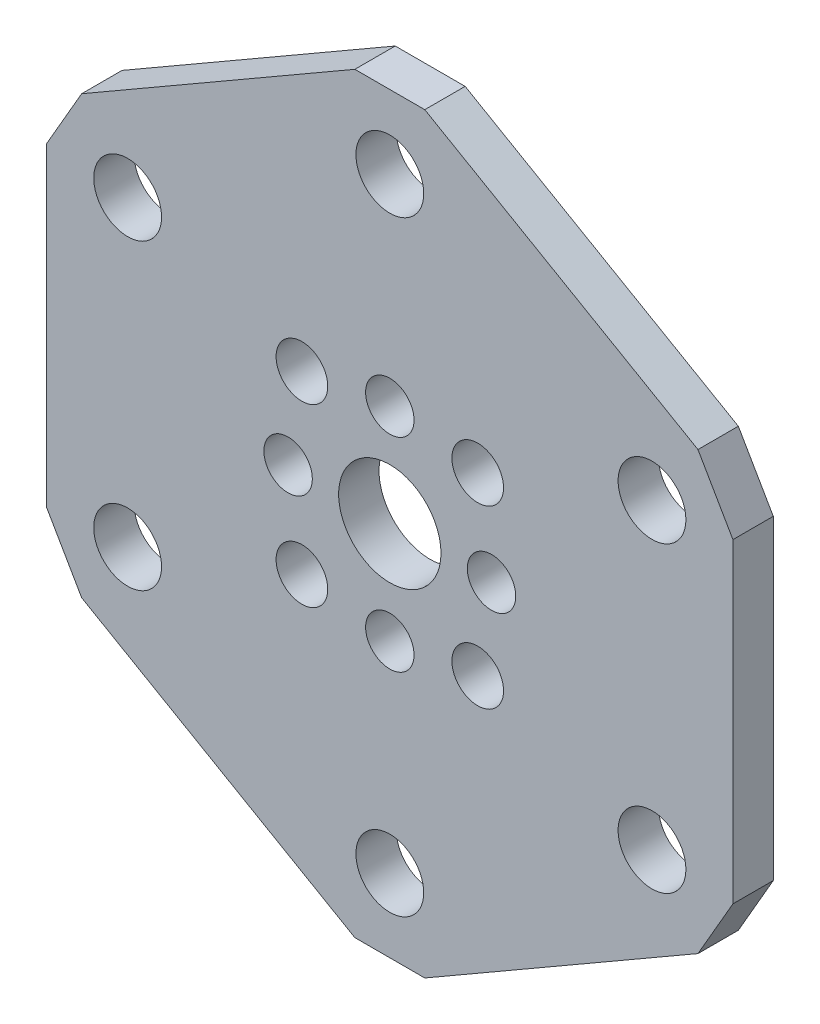
ISO-10303-21;
HEADER;
FILE_DESCRIPTION(('STEP AP214'),'2;1');
FILE_NAME('part.step','',(''),(''),'','','');
FILE_SCHEMA(('AUTOMOTIVE_DESIGN { 1 0 10303 214 1 1 1 1 }'));
ENDSEC;
DATA;
#1=APPLICATION_CONTEXT('core data for automotive mechanical design processes');
#2=APPLICATION_PROTOCOL_DEFINITION('international standard','automotive_design',2000,#1);
#3=PRODUCT_CONTEXT('',#1,'mechanical');
#4=PRODUCT('Part','Part','',(#3));
#5=PRODUCT_RELATED_PRODUCT_CATEGORY('part','',(#4));
#6=PRODUCT_DEFINITION_FORMATION('','',#4);
#7=PRODUCT_DEFINITION_CONTEXT('part definition',#1,'design');
#8=PRODUCT_DEFINITION('design','',#6,#7);
#9=PRODUCT_DEFINITION_SHAPE('','',#8);
#10=(LENGTH_UNIT() NAMED_UNIT(*) SI_UNIT(.MILLI.,.METRE.));
#11=(NAMED_UNIT(*) PLANE_ANGLE_UNIT() SI_UNIT($,.RADIAN.));
#12=(NAMED_UNIT(*) SI_UNIT($,.STERADIAN.) SOLID_ANGLE_UNIT());
#13=UNCERTAINTY_MEASURE_WITH_UNIT(LENGTH_MEASURE(1.E-05),#10,'distance_accuracy_value','');
#14=(GEOMETRIC_REPRESENTATION_CONTEXT(3) GLOBAL_UNCERTAINTY_ASSIGNED_CONTEXT((#13)) GLOBAL_UNIT_ASSIGNED_CONTEXT((#10,
#11,#12)) REPRESENTATION_CONTEXT('',''));
#15=CARTESIAN_POINT('',(0.,0.,0.));
#16=DIRECTION('',(0.,0.,1.));
#17=DIRECTION('',(1.,0.,0.));
#18=AXIS2_PLACEMENT_3D('',#15,#16,#17);
#19=CARTESIAN_POINT('',(-24.2378693429844,17.168740389755,3.175));
#20=DIRECTION('',(-0.5,0.866025403784439,0.));
#21=DIRECTION('',(-0.866025403784439,-0.5,0.));
#22=AXIS2_PLACEMENT_3D('',#19,#20,#21);
#23=PLANE('',#22);
#24=DIRECTION('',(0.866025403784439,0.5,0.));
#25=VECTOR('',#24,1.);
#26=CARTESIAN_POINT('',(-24.2378693429844,17.168740389755,0.));
#27=LINE('',#26,#25);
#28=CARTESIAN_POINT('',(-24.2378693429844,17.168740389755,0.));
#29=VERTEX_POINT('',#28);
#30=CARTESIAN_POINT('',(-2.74963065701559,29.5749807795101,0.));
#31=VERTEX_POINT('',#30);
#32=EDGE_CURVE('E153',#29,#31,#27,.T.);
#33=ORIENTED_EDGE('',*,*,#32,.F.);
#34=DIRECTION('',(0.,0.,-1.));
#35=VECTOR('',#34,1.);
#36=CARTESIAN_POINT('',(-24.2378693429844,17.168740389755,3.175));
#37=LINE('',#36,#35);
#38=CARTESIAN_POINT('',(-24.2378693429844,17.168740389755,3.175));
#39=VERTEX_POINT('',#38);
#40=EDGE_CURVE('E11',#39,#29,#37,.T.);
#41=ORIENTED_EDGE('',*,*,#40,.F.);
#42=DIRECTION('',(0.866025403784439,0.5,0.));
#43=VECTOR('',#42,1.);
#44=CARTESIAN_POINT('',(-24.2378693429844,17.168740389755,3.175));
#45=LINE('',#44,#43);
#46=CARTESIAN_POINT('',(-2.74963065701559,29.5749807795101,3.175));
#47=VERTEX_POINT('',#46);
#48=EDGE_CURVE('E186',#39,#47,#45,.T.);
#49=ORIENTED_EDGE('',*,*,#48,.T.);
#50=DIRECTION('',(0.,0.,-1.));
#51=VECTOR('',#50,1.);
#52=CARTESIAN_POINT('',(-2.74963065701559,29.5749807795101,3.175));
#53=LINE('',#52,#51);
#54=EDGE_CURVE('E35',#47,#31,#53,.T.);
#55=ORIENTED_EDGE('',*,*,#54,.T.);
#56=EDGE_LOOP('',(#33,#41,#49,#55));
#57=FACE_BOUND('',#56,.T.);
#58=ADVANCED_FACE('F32',(#57),#23,.T.);
#59=CARTESIAN_POINT('',(-26.9875,12.406240389755,3.175));
#60=DIRECTION('',(-0.866025403784438,0.5,0.));
#61=DIRECTION('',(-0.5,-0.866025403784439,0.));
#62=AXIS2_PLACEMENT_3D('',#59,#60,#61);
#63=PLANE('',#62);
#64=DIRECTION('',(0.5,0.866025403784439,0.));
#65=VECTOR('',#64,1.);
#66=CARTESIAN_POINT('',(-26.9875,12.406240389755,0.));
#67=LINE('',#66,#65);
#68=CARTESIAN_POINT('',(-26.9875,12.406240389755,0.));
#69=VERTEX_POINT('',#68);
#70=EDGE_CURVE('E184',#69,#29,#67,.T.);
#71=ORIENTED_EDGE('',*,*,#70,.F.);
#72=DIRECTION('',(0.,0.,-1.));
#73=VECTOR('',#72,1.);
#74=CARTESIAN_POINT('',(-26.9875,12.406240389755,3.175));
#75=LINE('',#74,#73);
#76=CARTESIAN_POINT('',(-26.9875,12.406240389755,3.175));
#77=VERTEX_POINT('',#76);
#78=EDGE_CURVE('E41',#77,#69,#75,.T.);
#79=ORIENTED_EDGE('',*,*,#78,.F.);
#80=DIRECTION('',(0.5,0.866025403784439,0.));
#81=VECTOR('',#80,1.);
#82=CARTESIAN_POINT('',(-26.9875,12.406240389755,3.175));
#83=LINE('',#82,#81);
#84=EDGE_CURVE('E143',#77,#39,#83,.T.);
#85=ORIENTED_EDGE('',*,*,#84,.T.);
#86=ORIENTED_EDGE('',*,*,#40,.T.);
#87=EDGE_LOOP('',(#71,#79,#85,#86));
#88=FACE_BOUND('',#87,.T.);
#89=ADVANCED_FACE('F206',(#88),#63,.T.);
#90=CARTESIAN_POINT('',(-26.9875,-12.406240389755,3.175));
#91=DIRECTION('',(-1.,0.,0.));
#92=DIRECTION('',(0.,-1.,0.));
#93=AXIS2_PLACEMENT_3D('',#90,#91,#92);
#94=PLANE('',#93);
#95=DIRECTION('',(0.,1.,0.));
#96=VECTOR('',#95,1.);
#97=CARTESIAN_POINT('',(-26.9875,-12.406240389755,0.));
#98=LINE('',#97,#96);
#99=CARTESIAN_POINT('',(-26.9875,-12.406240389755,0.));
#100=VERTEX_POINT('',#99);
#101=EDGE_CURVE('E130',#100,#69,#98,.T.);
#102=ORIENTED_EDGE('',*,*,#101,.F.);
#103=DIRECTION('',(0.,0.,-1.));
#104=VECTOR('',#103,1.);
#105=CARTESIAN_POINT('',(-26.9875,-12.406240389755,3.175));
#106=LINE('',#105,#104);
#107=CARTESIAN_POINT('',(-26.9875,-12.406240389755,3.175));
#108=VERTEX_POINT('',#107);
#109=EDGE_CURVE('E125',#108,#100,#106,.T.);
#110=ORIENTED_EDGE('',*,*,#109,.F.);
#111=DIRECTION('',(0.,1.,0.));
#112=VECTOR('',#111,1.);
#113=CARTESIAN_POINT('',(-26.9875,-12.406240389755,3.175));
#114=LINE('',#113,#112);
#115=EDGE_CURVE('E128',#108,#77,#114,.T.);
#116=ORIENTED_EDGE('',*,*,#115,.T.);
#117=ORIENTED_EDGE('',*,*,#78,.T.);
#118=EDGE_LOOP('',(#102,#110,#116,#117));
#119=FACE_BOUND('',#118,.T.);
#120=ADVANCED_FACE('F127',(#119),#94,.T.);
#121=CARTESIAN_POINT('',(-24.2378693429844,-17.168740389755,3.175));
#122=DIRECTION('',(-0.866025403784439,-0.5,0.));
#123=DIRECTION('',(0.5,-0.866025403784439,0.));
#124=AXIS2_PLACEMENT_3D('',#121,#122,#123);
#125=PLANE('',#124);
#126=DIRECTION('',(-0.5,0.866025403784439,0.));
#127=VECTOR('',#126,1.);
#128=CARTESIAN_POINT('',(-24.2378693429844,-17.168740389755,0.));
#129=LINE('',#128,#127);
#130=CARTESIAN_POINT('',(-24.2378693429844,-17.168740389755,0.));
#131=VERTEX_POINT('',#130);
#132=EDGE_CURVE('E181',#131,#100,#129,.T.);
#133=ORIENTED_EDGE('',*,*,#132,.F.);
#134=DIRECTION('',(0.,0.,-1.));
#135=VECTOR('',#134,1.);
#136=CARTESIAN_POINT('',(-24.2378693429844,-17.168740389755,3.175));
#137=LINE('',#136,#135);
#138=CARTESIAN_POINT('',(-24.2378693429844,-17.168740389755,3.175));
#139=VERTEX_POINT('',#138);
#140=EDGE_CURVE('E135',#139,#131,#137,.T.);
#141=ORIENTED_EDGE('',*,*,#140,.F.);
#142=DIRECTION('',(-0.5,0.866025403784439,0.));
#143=VECTOR('',#142,1.);
#144=CARTESIAN_POINT('',(-24.2378693429844,-17.168740389755,3.175));
#145=LINE('',#144,#143);
#146=EDGE_CURVE('E141',#139,#108,#145,.T.);
#147=ORIENTED_EDGE('',*,*,#146,.T.);
#148=ORIENTED_EDGE('',*,*,#109,.T.);
#149=EDGE_LOOP('',(#133,#141,#147,#148));
#150=FACE_BOUND('',#149,.T.);
#151=ADVANCED_FACE('F145',(#150),#125,.T.);
#152=CARTESIAN_POINT('',(-2.7496306570156,-29.57498077951,3.175));
#153=DIRECTION('',(-0.5,-0.866025403784439,0.));
#154=DIRECTION('',(0.866025403784439,-0.5,0.));
#155=AXIS2_PLACEMENT_3D('',#152,#153,#154);
#156=PLANE('',#155);
#157=DIRECTION('',(-0.866025403784438,0.5,0.));
#158=VECTOR('',#157,1.);
#159=CARTESIAN_POINT('',(-2.7496306570156,-29.57498077951,0.));
#160=LINE('',#159,#158);
#161=CARTESIAN_POINT('',(-2.7496306570156,-29.57498077951,0.));
#162=VERTEX_POINT('',#161);
#163=EDGE_CURVE('E178',#162,#131,#160,.T.);
#164=ORIENTED_EDGE('',*,*,#163,.F.);
#165=DIRECTION('',(0.,0.,-1.));
#166=VECTOR('',#165,1.);
#167=CARTESIAN_POINT('',(-2.7496306570156,-29.57498077951,3.175));
#168=LINE('',#167,#166);
#169=CARTESIAN_POINT('',(-2.7496306570156,-29.57498077951,3.175));
#170=VERTEX_POINT('',#169);
#171=EDGE_CURVE('E190',#170,#162,#168,.T.);
#172=ORIENTED_EDGE('',*,*,#171,.F.);
#173=DIRECTION('',(-0.866025403784438,0.5,0.));
#174=VECTOR('',#173,1.);
#175=CARTESIAN_POINT('',(-2.7496306570156,-29.57498077951,3.175));
#176=LINE('',#175,#174);
#177=EDGE_CURVE('E146',#170,#139,#176,.T.);
#178=ORIENTED_EDGE('',*,*,#177,.T.);
#179=ORIENTED_EDGE('',*,*,#140,.T.);
#180=EDGE_LOOP('',(#164,#172,#178,#179));
#181=FACE_BOUND('',#180,.T.);
#182=ADVANCED_FACE('F219',(#181),#156,.T.);
#183=CARTESIAN_POINT('',(2.74963065701558,-29.57498077951,3.175));
#184=DIRECTION('',(0.,-1.,0.));
#185=DIRECTION('',(0.,0.,-1.));
#186=AXIS2_PLACEMENT_3D('',#183,#184,#185);
#187=PLANE('',#186);
#188=DIRECTION('',(-1.,0.,0.));
#189=VECTOR('',#188,1.);
#190=CARTESIAN_POINT('',(2.74963065701558,-29.57498077951,0.));
#191=LINE('',#190,#189);
#192=CARTESIAN_POINT('',(2.74963065701558,-29.57498077951,0.));
#193=VERTEX_POINT('',#192);
#194=EDGE_CURVE('E175',#193,#162,#191,.T.);
#195=ORIENTED_EDGE('',*,*,#194,.F.);
#196=DIRECTION('',(0.,0.,-1.));
#197=VECTOR('',#196,1.);
#198=CARTESIAN_POINT('',(2.74963065701558,-29.57498077951,3.175));
#199=LINE('',#198,#197);
#200=CARTESIAN_POINT('',(2.74963065701558,-29.57498077951,3.175));
#201=VERTEX_POINT('',#200);
#202=EDGE_CURVE('E192',#201,#193,#199,.T.);
#203=ORIENTED_EDGE('',*,*,#202,.F.);
#204=DIRECTION('',(-1.,0.,0.));
#205=VECTOR('',#204,1.);
#206=CARTESIAN_POINT('',(2.74963065701558,-29.57498077951,3.175));
#207=LINE('',#206,#205);
#208=EDGE_CURVE('E148',#201,#170,#207,.T.);
#209=ORIENTED_EDGE('',*,*,#208,.T.);
#210=ORIENTED_EDGE('',*,*,#171,.T.);
#211=EDGE_LOOP('',(#195,#203,#209,#210));
#212=FACE_BOUND('',#211,.T.);
#213=ADVANCED_FACE('F222',(#212),#187,.T.);
#214=CARTESIAN_POINT('',(24.2378693429844,-17.168740389755,3.175));
#215=DIRECTION('',(0.5,-0.866025403784439,0.));
#216=DIRECTION('',(0.866025403784439,0.5,0.));
#217=AXIS2_PLACEMENT_3D('',#214,#215,#216);
#218=PLANE('',#217);
#219=DIRECTION('',(-0.866025403784439,-0.5,0.));
#220=VECTOR('',#219,1.);
#221=CARTESIAN_POINT('',(24.2378693429844,-17.168740389755,0.));
#222=LINE('',#221,#220);
#223=CARTESIAN_POINT('',(24.2378693429844,-17.168740389755,0.));
#224=VERTEX_POINT('',#223);
#225=EDGE_CURVE('E172',#224,#193,#222,.T.);
#226=ORIENTED_EDGE('',*,*,#225,.F.);
#227=DIRECTION('',(0.,0.,-1.));
#228=VECTOR('',#227,1.);
#229=CARTESIAN_POINT('',(24.2378693429844,-17.168740389755,3.175));
#230=LINE('',#229,#228);
#231=CARTESIAN_POINT('',(24.2378693429844,-17.168740389755,3.175));
#232=VERTEX_POINT('',#231);
#233=EDGE_CURVE('E194',#232,#224,#230,.T.);
#234=ORIENTED_EDGE('',*,*,#233,.F.);
#235=DIRECTION('',(-0.866025403784439,-0.5,0.));
#236=VECTOR('',#235,1.);
#237=CARTESIAN_POINT('',(24.2378693429844,-17.168740389755,3.175));
#238=LINE('',#237,#236);
#239=EDGE_CURVE('E426',#232,#201,#238,.T.);
#240=ORIENTED_EDGE('',*,*,#239,.T.);
#241=ORIENTED_EDGE('',*,*,#202,.T.);
#242=EDGE_LOOP('',(#226,#234,#240,#241));
#243=FACE_BOUND('',#242,.T.);
#244=ADVANCED_FACE('F226',(#243),#218,.T.);
#245=CARTESIAN_POINT('',(26.9875,-12.406240389755,3.175));
#246=DIRECTION('',(0.866025403784438,-0.5,0.));
#247=DIRECTION('',(0.5,0.866025403784439,0.));
#248=AXIS2_PLACEMENT_3D('',#245,#246,#247);
#249=PLANE('',#248);
#250=DIRECTION('',(-0.5,-0.866025403784438,0.));
#251=VECTOR('',#250,1.);
#252=CARTESIAN_POINT('',(26.9875,-12.406240389755,0.));
#253=LINE('',#252,#251);
#254=CARTESIAN_POINT('',(26.9875,-12.406240389755,0.));
#255=VERTEX_POINT('',#254);
#256=EDGE_CURVE('E169',#255,#224,#253,.T.);
#257=ORIENTED_EDGE('',*,*,#256,.F.);
#258=DIRECTION('',(0.,0.,-1.));
#259=VECTOR('',#258,1.);
#260=CARTESIAN_POINT('',(26.9875,-12.406240389755,3.175));
#261=LINE('',#260,#259);
#262=CARTESIAN_POINT('',(26.9875,-12.406240389755,3.175));
#263=VERTEX_POINT('',#262);
#264=EDGE_CURVE('E196',#263,#255,#261,.T.);
#265=ORIENTED_EDGE('',*,*,#264,.F.);
#266=DIRECTION('',(-0.5,-0.866025403784438,0.));
#267=VECTOR('',#266,1.);
#268=CARTESIAN_POINT('',(26.9875,-12.406240389755,3.175));
#269=LINE('',#268,#267);
#270=EDGE_CURVE('E423',#263,#232,#269,.T.);
#271=ORIENTED_EDGE('',*,*,#270,.T.);
#272=ORIENTED_EDGE('',*,*,#233,.T.);
#273=EDGE_LOOP('',(#257,#265,#271,#272));
#274=FACE_BOUND('',#273,.T.);
#275=ADVANCED_FACE('F230',(#274),#249,.T.);
#276=CARTESIAN_POINT('',(26.9875,12.406240389755,3.175));
#277=DIRECTION('',(1.,0.,0.));
#278=DIRECTION('',(0.,1.,0.));
#279=AXIS2_PLACEMENT_3D('',#276,#277,#278);
#280=PLANE('',#279);
#281=DIRECTION('',(0.,-1.,0.));
#282=VECTOR('',#281,1.);
#283=CARTESIAN_POINT('',(26.9875,12.406240389755,0.));
#284=LINE('',#283,#282);
#285=CARTESIAN_POINT('',(26.9875,12.406240389755,0.));
#286=VERTEX_POINT('',#285);
#287=EDGE_CURVE('E166',#286,#255,#284,.T.);
#288=ORIENTED_EDGE('',*,*,#287,.F.);
#289=DIRECTION('',(0.,0.,-1.));
#290=VECTOR('',#289,1.);
#291=CARTESIAN_POINT('',(26.9875,12.406240389755,3.175));
#292=LINE('',#291,#290);
#293=CARTESIAN_POINT('',(26.9875,12.406240389755,3.175));
#294=VERTEX_POINT('',#293);
#295=EDGE_CURVE('E198',#294,#286,#292,.T.);
#296=ORIENTED_EDGE('',*,*,#295,.F.);
#297=DIRECTION('',(0.,-1.,0.));
#298=VECTOR('',#297,1.);
#299=CARTESIAN_POINT('',(26.9875,12.406240389755,3.175));
#300=LINE('',#299,#298);
#301=EDGE_CURVE('E420',#294,#263,#300,.T.);
#302=ORIENTED_EDGE('',*,*,#301,.T.);
#303=ORIENTED_EDGE('',*,*,#264,.T.);
#304=EDGE_LOOP('',(#288,#296,#302,#303));
#305=FACE_BOUND('',#304,.T.);
#306=ADVANCED_FACE('F234',(#305),#280,.T.);
#307=CARTESIAN_POINT('',(24.2378693429844,17.168740389755,3.175));
#308=DIRECTION('',(0.866025403784439,0.5,0.));
#309=DIRECTION('',(-0.5,0.866025403784439,0.));
#310=AXIS2_PLACEMENT_3D('',#307,#308,#309);
#311=PLANE('',#310);
#312=DIRECTION('',(0.5,-0.866025403784439,0.));
#313=VECTOR('',#312,1.);
#314=CARTESIAN_POINT('',(24.2378693429844,17.168740389755,0.));
#315=LINE('',#314,#313);
#316=CARTESIAN_POINT('',(24.2378693429844,17.168740389755,0.));
#317=VERTEX_POINT('',#316);
#318=EDGE_CURVE('E163',#317,#286,#315,.T.);
#319=ORIENTED_EDGE('',*,*,#318,.F.);
#320=DIRECTION('',(0.,0.,-1.));
#321=VECTOR('',#320,1.);
#322=CARTESIAN_POINT('',(24.2378693429844,17.168740389755,3.175));
#323=LINE('',#322,#321);
#324=CARTESIAN_POINT('',(24.2378693429844,17.168740389755,3.175));
#325=VERTEX_POINT('',#324);
#326=EDGE_CURVE('E200',#325,#317,#323,.T.);
#327=ORIENTED_EDGE('',*,*,#326,.F.);
#328=DIRECTION('',(0.5,-0.866025403784439,0.));
#329=VECTOR('',#328,1.);
#330=CARTESIAN_POINT('',(24.2378693429844,17.168740389755,3.175));
#331=LINE('',#330,#329);
#332=EDGE_CURVE('E417',#325,#294,#331,.T.);
#333=ORIENTED_EDGE('',*,*,#332,.T.);
#334=ORIENTED_EDGE('',*,*,#295,.T.);
#335=EDGE_LOOP('',(#319,#327,#333,#334));
#336=FACE_BOUND('',#335,.T.);
#337=ADVANCED_FACE('F238',(#336),#311,.T.);
#338=CARTESIAN_POINT('',(2.74963065701559,29.5749807795101,3.175));
#339=DIRECTION('',(0.5,0.866025403784438,0.));
#340=DIRECTION('',(-0.866025403784439,0.5,0.));
#341=AXIS2_PLACEMENT_3D('',#338,#339,#340);
#342=PLANE('',#341);
#343=DIRECTION('',(0.866025403784438,-0.5,0.));
#344=VECTOR('',#343,1.);
#345=CARTESIAN_POINT('',(2.74963065701559,29.5749807795101,0.));
#346=LINE('',#345,#344);
#347=CARTESIAN_POINT('',(2.74963065701559,29.5749807795101,0.));
#348=VERTEX_POINT('',#347);
#349=EDGE_CURVE('E160',#348,#317,#346,.T.);
#350=ORIENTED_EDGE('',*,*,#349,.F.);
#351=DIRECTION('',(0.,0.,-1.));
#352=VECTOR('',#351,1.);
#353=CARTESIAN_POINT('',(2.74963065701559,29.5749807795101,3.175));
#354=LINE('',#353,#352);
#355=CARTESIAN_POINT('',(2.74963065701559,29.5749807795101,3.175));
#356=VERTEX_POINT('',#355);
#357=EDGE_CURVE('E201',#356,#348,#354,.T.);
#358=ORIENTED_EDGE('',*,*,#357,.F.);
#359=DIRECTION('',(0.866025403784438,-0.5,0.));
#360=VECTOR('',#359,1.);
#361=CARTESIAN_POINT('',(2.74963065701559,29.5749807795101,3.175));
#362=LINE('',#361,#360);
#363=EDGE_CURVE('E414',#356,#325,#362,.T.);
#364=ORIENTED_EDGE('',*,*,#363,.T.);
#365=ORIENTED_EDGE('',*,*,#326,.T.);
#366=EDGE_LOOP('',(#350,#358,#364,#365));
#367=FACE_BOUND('',#366,.T.);
#368=ADVANCED_FACE('F242',(#367),#342,.T.);
#369=CARTESIAN_POINT('',(-2.74963065701559,29.5749807795101,3.175));
#370=DIRECTION('',(0.,1.,0.));
#371=DIRECTION('',(0.,0.,1.));
#372=AXIS2_PLACEMENT_3D('',#369,#370,#371);
#373=PLANE('',#372);
#374=DIRECTION('',(1.,0.,0.));
#375=VECTOR('',#374,1.);
#376=CARTESIAN_POINT('',(-2.74963065701559,29.5749807795101,0.));
#377=LINE('',#376,#375);
#378=EDGE_CURVE('E156',#31,#348,#377,.T.);
#379=ORIENTED_EDGE('',*,*,#378,.F.);
#380=ORIENTED_EDGE('',*,*,#54,.F.);
#381=DIRECTION('',(1.,0.,0.));
#382=VECTOR('',#381,1.);
#383=CARTESIAN_POINT('',(-2.74963065701559,29.5749807795101,3.175));
#384=LINE('',#383,#382);
#385=EDGE_CURVE('E412',#47,#356,#384,.T.);
#386=ORIENTED_EDGE('',*,*,#385,.T.);
#387=ORIENTED_EDGE('',*,*,#357,.T.);
#388=EDGE_LOOP('',(#379,#380,#386,#387));
#389=FACE_BOUND('',#388,.T.);
#390=ADVANCED_FACE('F203',(#389),#373,.T.);
#391=CARTESIAN_POINT('',(0.,0.,3.175));
#392=DIRECTION('',(0.,0.,-1.));
#393=DIRECTION('',(-1.,0.,0.));
#394=AXIS2_PLACEMENT_3D('',#391,#392,#393);
#395=PLANE('',#394);
#396=CARTESIAN_POINT('',(-6.91479721322323,6.91479721322326,3.175));
#397=DIRECTION('',(0.,0.,-1.));
#398=DIRECTION('',(1.,0.,0.));
#399=AXIS2_PLACEMENT_3D('',#396,#397,#398);
#400=CIRCLE('',#399,2.03200000000004);
#401=CARTESIAN_POINT('',(-4.88279721322319,6.91479721322326,3.175));
#402=VERTEX_POINT('',#401);
#403=EDGE_CURVE('E321',#402,#402,#400,.T.);
#404=ORIENTED_EDGE('',*,*,#403,.T.);
#405=EDGE_LOOP('',(#404));
#406=FACE_BOUND('',#405,.T.);
#407=CARTESIAN_POINT('',(-6.91479721322326,-6.91479721322323,3.175));
#408=DIRECTION('',(0.,0.,-1.));
#409=DIRECTION('',(1.,0.,0.));
#410=AXIS2_PLACEMENT_3D('',#407,#408,#409);
#411=CIRCLE('',#410,2.03200000000003);
#412=CARTESIAN_POINT('',(-4.88279721322323,-6.91479721322323,3.175));
#413=VERTEX_POINT('',#412);
#414=EDGE_CURVE('E329',#413,#413,#411,.T.);
#415=ORIENTED_EDGE('',*,*,#414,.T.);
#416=EDGE_LOOP('',(#415));
#417=FACE_BOUND('',#416,.T.);
#418=CARTESIAN_POINT('',(6.91479721322321,-6.91479721322328,3.175));
#419=DIRECTION('',(0.,0.,-1.));
#420=DIRECTION('',(1.,0.,0.));
#421=AXIS2_PLACEMENT_3D('',#418,#419,#420);
#422=CIRCLE('',#421,2.032);
#423=CARTESIAN_POINT('',(8.94679721322321,-6.91479721322328,3.175));
#424=VERTEX_POINT('',#423);
#425=EDGE_CURVE('E335',#424,#424,#422,.T.);
#426=ORIENTED_EDGE('',*,*,#425,.T.);
#427=EDGE_LOOP('',(#426));
#428=FACE_BOUND('',#427,.T.);
#429=CARTESIAN_POINT('',(6.91479721322326,6.91479721322323,3.175));
#430=DIRECTION('',(0.,0.,-1.));
#431=DIRECTION('',(1.,0.,0.));
#432=AXIS2_PLACEMENT_3D('',#429,#430,#431);
#433=CIRCLE('',#432,2.032);
#434=CARTESIAN_POINT('',(8.94679721322326,6.91479721322323,3.175));
#435=VERTEX_POINT('',#434);
#436=EDGE_CURVE('E341',#435,#435,#433,.T.);
#437=ORIENTED_EDGE('',*,*,#436,.T.);
#438=EDGE_LOOP('',(#437));
#439=FACE_BOUND('',#438,.T.);
#440=CARTESIAN_POINT('',(-20.6222299276169,-11.90625,3.175));
#441=DIRECTION('',(0.,0.,-1.));
#442=DIRECTION('',(1.,0.,0.));
#443=AXIS2_PLACEMENT_3D('',#440,#441,#442);
#444=CIRCLE('',#443,2.66700000000022);
#445=CARTESIAN_POINT('',(-17.9552299276167,-11.90625,3.175));
#446=VERTEX_POINT('',#445);
#447=EDGE_CURVE('E347',#446,#446,#444,.T.);
#448=ORIENTED_EDGE('',*,*,#447,.T.);
#449=EDGE_LOOP('',(#448));
#450=FACE_BOUND('',#449,.T.);
#451=CARTESIAN_POINT('',(20.6222299276169,-11.9062500000001,3.175));
#452=DIRECTION('',(0.,0.,-1.));
#453=DIRECTION('',(1.,0.,0.));
#454=AXIS2_PLACEMENT_3D('',#451,#452,#453);
#455=CIRCLE('',#454,2.667);
#456=CARTESIAN_POINT('',(23.2892299276169,-11.9062500000001,3.175));
#457=VERTEX_POINT('',#456);
#458=EDGE_CURVE('E353',#457,#457,#455,.T.);
#459=ORIENTED_EDGE('',*,*,#458,.T.);
#460=EDGE_LOOP('',(#459));
#461=FACE_BOUND('',#460,.T.);
#462=CARTESIAN_POINT('',(-8.,0.,3.175));
#463=DIRECTION('',(0.,0.,-1.));
#464=DIRECTION('',(1.,0.,0.));
#465=AXIS2_PLACEMENT_3D('',#462,#463,#464);
#466=CIRCLE('',#465,1.90500000000008);
#467=CARTESIAN_POINT('',(-6.09499999999992,0.,3.175));
#468=VERTEX_POINT('',#467);
#469=EDGE_CURVE('E359',#468,#468,#466,.T.);
#470=ORIENTED_EDGE('',*,*,#469,.T.);
#471=EDGE_LOOP('',(#470));
#472=FACE_BOUND('',#471,.T.);
#473=CARTESIAN_POINT('',(8.,0.,3.175));
#474=DIRECTION('',(0.,0.,-1.));
#475=DIRECTION('',(1.,0.,0.));
#476=AXIS2_PLACEMENT_3D('',#473,#474,#475);
#477=CIRCLE('',#476,1.905);
#478=CARTESIAN_POINT('',(9.905,0.,3.175));
#479=VERTEX_POINT('',#478);
#480=EDGE_CURVE('E365',#479,#479,#477,.T.);
#481=ORIENTED_EDGE('',*,*,#480,.T.);
#482=EDGE_LOOP('',(#481));
#483=FACE_BOUND('',#482,.T.);
#484=CARTESIAN_POINT('',(0.,0.,3.175));
#485=DIRECTION('',(0.,0.,-1.));
#486=DIRECTION('',(1.,0.,0.));
#487=AXIS2_PLACEMENT_3D('',#484,#485,#486);
#488=CIRCLE('',#487,4.025);
#489=CARTESIAN_POINT('',(4.025,0.,3.175));
#490=VERTEX_POINT('',#489);
#491=EDGE_CURVE('E371',#490,#490,#488,.T.);
#492=ORIENTED_EDGE('',*,*,#491,.T.);
#493=EDGE_LOOP('',(#492));
#494=FACE_BOUND('',#493,.T.);
#495=CARTESIAN_POINT('',(0.,23.8125,3.175));
#496=DIRECTION('',(0.,0.,-1.));
#497=DIRECTION('',(1.,0.,0.));
#498=AXIS2_PLACEMENT_3D('',#495,#496,#497);
#499=CIRCLE('',#498,2.66699999999999);
#500=CARTESIAN_POINT('',(2.667,23.8125,3.175));
#501=VERTEX_POINT('',#500);
#502=EDGE_CURVE('E377',#501,#501,#499,.T.);
#503=ORIENTED_EDGE('',*,*,#502,.T.);
#504=EDGE_LOOP('',(#503));
#505=FACE_BOUND('',#504,.T.);
#506=CARTESIAN_POINT('',(0.,8.,3.175));
#507=DIRECTION('',(0.,0.,-1.));
#508=DIRECTION('',(1.,0.,0.));
#509=AXIS2_PLACEMENT_3D('',#506,#507,#508);
#510=CIRCLE('',#509,1.905);
#511=CARTESIAN_POINT('',(1.905,8.,3.175));
#512=VERTEX_POINT('',#511);
#513=EDGE_CURVE('E383',#512,#512,#510,.T.);
#514=ORIENTED_EDGE('',*,*,#513,.T.);
#515=EDGE_LOOP('',(#514));
#516=FACE_BOUND('',#515,.T.);
#517=CARTESIAN_POINT('',(0.,-8.,3.175));
#518=DIRECTION('',(0.,0.,-1.));
#519=DIRECTION('',(1.,0.,0.));
#520=AXIS2_PLACEMENT_3D('',#517,#518,#519);
#521=CIRCLE('',#520,1.90500000000005);
#522=CARTESIAN_POINT('',(1.90500000000005,-8.,3.175));
#523=VERTEX_POINT('',#522);
#524=EDGE_CURVE('E389',#523,#523,#521,.T.);
#525=ORIENTED_EDGE('',*,*,#524,.T.);
#526=EDGE_LOOP('',(#525));
#527=FACE_BOUND('',#526,.T.);
#528=CARTESIAN_POINT('',(20.622229927617,11.90625,3.175));
#529=DIRECTION('',(0.,0.,-1.));
#530=DIRECTION('',(1.,0.,0.));
#531=AXIS2_PLACEMENT_3D('',#528,#529,#530);
#532=CIRCLE('',#531,2.667);
#533=CARTESIAN_POINT('',(23.289229927617,11.90625,3.175));
#534=VERTEX_POINT('',#533);
#535=EDGE_CURVE('E395',#534,#534,#532,.T.);
#536=ORIENTED_EDGE('',*,*,#535,.T.);
#537=EDGE_LOOP('',(#536));
#538=FACE_BOUND('',#537,.T.);
#539=CARTESIAN_POINT('',(0.,-23.8125,3.175));
#540=DIRECTION('',(0.,0.,-1.));
#541=DIRECTION('',(1.,0.,0.));
#542=AXIS2_PLACEMENT_3D('',#539,#540,#541);
#543=CIRCLE('',#542,2.66700000000016);
#544=CARTESIAN_POINT('',(2.66700000000015,-23.8125,3.175));
#545=VERTEX_POINT('',#544);
#546=EDGE_CURVE('E401',#545,#545,#543,.T.);
#547=ORIENTED_EDGE('',*,*,#546,.T.);
#548=EDGE_LOOP('',(#547));
#549=FACE_BOUND('',#548,.T.);
#550=CARTESIAN_POINT('',(-20.6222299276168,11.9062500000002,3.175));
#551=DIRECTION('',(0.,0.,-1.));
#552=DIRECTION('',(1.,0.,0.));
#553=AXIS2_PLACEMENT_3D('',#550,#551,#552);
#554=CIRCLE('',#553,2.667);
#555=CARTESIAN_POINT('',(-17.9552299276168,11.9062500000002,3.175));
#556=VERTEX_POINT('',#555);
#557=EDGE_CURVE('E157',#556,#556,#554,.T.);
#558=ORIENTED_EDGE('',*,*,#557,.T.);
#559=EDGE_LOOP('',(#558));
#560=FACE_BOUND('',#559,.T.);
#561=ORIENTED_EDGE('',*,*,#48,.F.);
#562=ORIENTED_EDGE('',*,*,#84,.F.);
#563=ORIENTED_EDGE('',*,*,#115,.F.);
#564=ORIENTED_EDGE('',*,*,#146,.F.);
#565=ORIENTED_EDGE('',*,*,#177,.F.);
#566=ORIENTED_EDGE('',*,*,#208,.F.);
#567=ORIENTED_EDGE('',*,*,#239,.F.);
#568=ORIENTED_EDGE('',*,*,#270,.F.);
#569=ORIENTED_EDGE('',*,*,#301,.F.);
#570=ORIENTED_EDGE('',*,*,#332,.F.);
#571=ORIENTED_EDGE('',*,*,#363,.F.);
#572=ORIENTED_EDGE('',*,*,#385,.F.);
#573=EDGE_LOOP('',(#561,#562,#563,#564,#565,#566,#567,#568,#569,#570,#571,#572));
#574=FACE_BOUND('',#573,.T.);
#575=ADVANCED_FACE('F139',(#406,#417,#428,#439,#450,#461,#472,#483,#494,#505,#516,#527,#538,
#549,#560,#574),#395,.F.);
#576=CARTESIAN_POINT('',(0.,0.,0.));
#577=DIRECTION('',(0.,0.,-1.));
#578=DIRECTION('',(-1.,0.,0.));
#579=AXIS2_PLACEMENT_3D('',#576,#577,#578);
#580=PLANE('',#579);
#581=CARTESIAN_POINT('',(-6.91479721322323,6.91479721322326,0.));
#582=DIRECTION('',(0.,0.,-1.));
#583=DIRECTION('',(1.,0.,0.));
#584=AXIS2_PLACEMENT_3D('',#581,#582,#583);
#585=CIRCLE('',#584,2.03200000000004);
#586=CARTESIAN_POINT('',(-4.88279721322319,6.91479721322326,0.));
#587=VERTEX_POINT('',#586);
#588=EDGE_CURVE('E324',#587,#587,#585,.T.);
#589=ORIENTED_EDGE('',*,*,#588,.F.);
#590=EDGE_LOOP('',(#589));
#591=FACE_BOUND('',#590,.T.);
#592=CARTESIAN_POINT('',(-6.91479721322326,-6.91479721322323,0.));
#593=DIRECTION('',(0.,0.,-1.));
#594=DIRECTION('',(1.,0.,0.));
#595=AXIS2_PLACEMENT_3D('',#592,#593,#594);
#596=CIRCLE('',#595,2.03200000000003);
#597=CARTESIAN_POINT('',(-4.88279721322323,-6.91479721322323,0.));
#598=VERTEX_POINT('',#597);
#599=EDGE_CURVE('E326',#598,#598,#596,.T.);
#600=ORIENTED_EDGE('',*,*,#599,.F.);
#601=EDGE_LOOP('',(#600));
#602=FACE_BOUND('',#601,.T.);
#603=CARTESIAN_POINT('',(6.91479721322321,-6.91479721322328,0.));
#604=DIRECTION('',(0.,0.,-1.));
#605=DIRECTION('',(1.,0.,0.));
#606=AXIS2_PLACEMENT_3D('',#603,#604,#605);
#607=CIRCLE('',#606,2.032);
#608=CARTESIAN_POINT('',(8.94679721322321,-6.91479721322328,0.));
#609=VERTEX_POINT('',#608);
#610=EDGE_CURVE('E332',#609,#609,#607,.T.);
#611=ORIENTED_EDGE('',*,*,#610,.F.);
#612=EDGE_LOOP('',(#611));
#613=FACE_BOUND('',#612,.T.);
#614=CARTESIAN_POINT('',(6.91479721322326,6.91479721322323,0.));
#615=DIRECTION('',(0.,0.,-1.));
#616=DIRECTION('',(1.,0.,0.));
#617=AXIS2_PLACEMENT_3D('',#614,#615,#616);
#618=CIRCLE('',#617,2.032);
#619=CARTESIAN_POINT('',(8.94679721322326,6.91479721322323,0.));
#620=VERTEX_POINT('',#619);
#621=EDGE_CURVE('E338',#620,#620,#618,.T.);
#622=ORIENTED_EDGE('',*,*,#621,.F.);
#623=EDGE_LOOP('',(#622));
#624=FACE_BOUND('',#623,.T.);
#625=CARTESIAN_POINT('',(-20.6222299276169,-11.90625,0.));
#626=DIRECTION('',(0.,0.,-1.));
#627=DIRECTION('',(1.,0.,0.));
#628=AXIS2_PLACEMENT_3D('',#625,#626,#627);
#629=CIRCLE('',#628,2.66700000000022);
#630=CARTESIAN_POINT('',(-17.9552299276167,-11.90625,0.));
#631=VERTEX_POINT('',#630);
#632=EDGE_CURVE('E344',#631,#631,#629,.T.);
#633=ORIENTED_EDGE('',*,*,#632,.F.);
#634=EDGE_LOOP('',(#633));
#635=FACE_BOUND('',#634,.T.);
#636=CARTESIAN_POINT('',(20.6222299276169,-11.9062500000001,0.));
#637=DIRECTION('',(0.,0.,-1.));
#638=DIRECTION('',(1.,0.,0.));
#639=AXIS2_PLACEMENT_3D('',#636,#637,#638);
#640=CIRCLE('',#639,2.667);
#641=CARTESIAN_POINT('',(23.2892299276169,-11.9062500000001,0.));
#642=VERTEX_POINT('',#641);
#643=EDGE_CURVE('E350',#642,#642,#640,.T.);
#644=ORIENTED_EDGE('',*,*,#643,.F.);
#645=EDGE_LOOP('',(#644));
#646=FACE_BOUND('',#645,.T.);
#647=CARTESIAN_POINT('',(-8.,0.,0.));
#648=DIRECTION('',(0.,0.,-1.));
#649=DIRECTION('',(1.,0.,0.));
#650=AXIS2_PLACEMENT_3D('',#647,#648,#649);
#651=CIRCLE('',#650,1.90500000000008);
#652=CARTESIAN_POINT('',(-6.09499999999992,0.,0.));
#653=VERTEX_POINT('',#652);
#654=EDGE_CURVE('E356',#653,#653,#651,.T.);
#655=ORIENTED_EDGE('',*,*,#654,.F.);
#656=EDGE_LOOP('',(#655));
#657=FACE_BOUND('',#656,.T.);
#658=CARTESIAN_POINT('',(8.,0.,0.));
#659=DIRECTION('',(0.,0.,-1.));
#660=DIRECTION('',(1.,0.,0.));
#661=AXIS2_PLACEMENT_3D('',#658,#659,#660);
#662=CIRCLE('',#661,1.905);
#663=CARTESIAN_POINT('',(9.905,0.,0.));
#664=VERTEX_POINT('',#663);
#665=EDGE_CURVE('E362',#664,#664,#662,.T.);
#666=ORIENTED_EDGE('',*,*,#665,.F.);
#667=EDGE_LOOP('',(#666));
#668=FACE_BOUND('',#667,.T.);
#669=CARTESIAN_POINT('',(0.,0.,0.));
#670=DIRECTION('',(0.,0.,-1.));
#671=DIRECTION('',(1.,0.,0.));
#672=AXIS2_PLACEMENT_3D('',#669,#670,#671);
#673=CIRCLE('',#672,4.025);
#674=CARTESIAN_POINT('',(4.025,0.,0.));
#675=VERTEX_POINT('',#674);
#676=EDGE_CURVE('E368',#675,#675,#673,.T.);
#677=ORIENTED_EDGE('',*,*,#676,.F.);
#678=EDGE_LOOP('',(#677));
#679=FACE_BOUND('',#678,.T.);
#680=CARTESIAN_POINT('',(0.,23.8125,0.));
#681=DIRECTION('',(0.,0.,-1.));
#682=DIRECTION('',(1.,0.,0.));
#683=AXIS2_PLACEMENT_3D('',#680,#681,#682);
#684=CIRCLE('',#683,2.66699999999999);
#685=CARTESIAN_POINT('',(2.667,23.8125,0.));
#686=VERTEX_POINT('',#685);
#687=EDGE_CURVE('E374',#686,#686,#684,.T.);
#688=ORIENTED_EDGE('',*,*,#687,.F.);
#689=EDGE_LOOP('',(#688));
#690=FACE_BOUND('',#689,.T.);
#691=CARTESIAN_POINT('',(0.,8.,0.));
#692=DIRECTION('',(0.,0.,-1.));
#693=DIRECTION('',(1.,0.,0.));
#694=AXIS2_PLACEMENT_3D('',#691,#692,#693);
#695=CIRCLE('',#694,1.905);
#696=CARTESIAN_POINT('',(1.905,8.,0.));
#697=VERTEX_POINT('',#696);
#698=EDGE_CURVE('E380',#697,#697,#695,.T.);
#699=ORIENTED_EDGE('',*,*,#698,.F.);
#700=EDGE_LOOP('',(#699));
#701=FACE_BOUND('',#700,.T.);
#702=CARTESIAN_POINT('',(0.,-8.,0.));
#703=DIRECTION('',(0.,0.,-1.));
#704=DIRECTION('',(1.,0.,0.));
#705=AXIS2_PLACEMENT_3D('',#702,#703,#704);
#706=CIRCLE('',#705,1.90500000000005);
#707=CARTESIAN_POINT('',(1.90500000000005,-8.,0.));
#708=VERTEX_POINT('',#707);
#709=EDGE_CURVE('E386',#708,#708,#706,.T.);
#710=ORIENTED_EDGE('',*,*,#709,.F.);
#711=EDGE_LOOP('',(#710));
#712=FACE_BOUND('',#711,.T.);
#713=CARTESIAN_POINT('',(20.622229927617,11.90625,0.));
#714=DIRECTION('',(0.,0.,-1.));
#715=DIRECTION('',(1.,0.,0.));
#716=AXIS2_PLACEMENT_3D('',#713,#714,#715);
#717=CIRCLE('',#716,2.667);
#718=CARTESIAN_POINT('',(23.289229927617,11.90625,0.));
#719=VERTEX_POINT('',#718);
#720=EDGE_CURVE('E392',#719,#719,#717,.T.);
#721=ORIENTED_EDGE('',*,*,#720,.F.);
#722=EDGE_LOOP('',(#721));
#723=FACE_BOUND('',#722,.T.);
#724=CARTESIAN_POINT('',(0.,-23.8125,0.));
#725=DIRECTION('',(0.,0.,-1.));
#726=DIRECTION('',(1.,0.,0.));
#727=AXIS2_PLACEMENT_3D('',#724,#725,#726);
#728=CIRCLE('',#727,2.66700000000016);
#729=CARTESIAN_POINT('',(2.66700000000015,-23.8125,0.));
#730=VERTEX_POINT('',#729);
#731=EDGE_CURVE('E398',#730,#730,#728,.T.);
#732=ORIENTED_EDGE('',*,*,#731,.F.);
#733=EDGE_LOOP('',(#732));
#734=FACE_BOUND('',#733,.T.);
#735=CARTESIAN_POINT('',(-20.6222299276168,11.9062500000002,0.));
#736=DIRECTION('',(0.,0.,-1.));
#737=DIRECTION('',(1.,0.,0.));
#738=AXIS2_PLACEMENT_3D('',#735,#736,#737);
#739=CIRCLE('',#738,2.667);
#740=CARTESIAN_POINT('',(-17.9552299276168,11.9062500000002,0.));
#741=VERTEX_POINT('',#740);
#742=EDGE_CURVE('E404',#741,#741,#739,.T.);
#743=ORIENTED_EDGE('',*,*,#742,.F.);
#744=EDGE_LOOP('',(#743));
#745=FACE_BOUND('',#744,.T.);
#746=ORIENTED_EDGE('',*,*,#32,.T.);
#747=ORIENTED_EDGE('',*,*,#378,.T.);
#748=ORIENTED_EDGE('',*,*,#349,.T.);
#749=ORIENTED_EDGE('',*,*,#318,.T.);
#750=ORIENTED_EDGE('',*,*,#287,.T.);
#751=ORIENTED_EDGE('',*,*,#256,.T.);
#752=ORIENTED_EDGE('',*,*,#225,.T.);
#753=ORIENTED_EDGE('',*,*,#194,.T.);
#754=ORIENTED_EDGE('',*,*,#163,.T.);
#755=ORIENTED_EDGE('',*,*,#132,.T.);
#756=ORIENTED_EDGE('',*,*,#101,.T.);
#757=ORIENTED_EDGE('',*,*,#70,.T.);
#758=EDGE_LOOP('',(#746,#747,#748,#749,#750,#751,#752,#753,#754,#755,#756,#757));
#759=FACE_BOUND('',#758,.T.);
#760=ADVANCED_FACE('F205',(#591,#602,#613,#624,#635,#646,#657,#668,#679,#690,#701,#712,#723,
#734,#745,#759),#580,.T.);
#761=CARTESIAN_POINT('',(-20.6222299276168,11.9062500000002,3.175));
#762=DIRECTION('',(0.,0.,-1.));
#763=DIRECTION('',(-1.,0.,0.));
#764=AXIS2_PLACEMENT_3D('',#761,#762,#763);
#765=CYLINDRICAL_SURFACE('',#764,2.667);
#766=ORIENTED_EDGE('',*,*,#557,.F.);
#767=EDGE_LOOP('',(#766));
#768=FACE_BOUND('',#767,.T.);
#769=ORIENTED_EDGE('',*,*,#742,.T.);
#770=EDGE_LOOP('',(#769));
#771=FACE_BOUND('',#770,.T.);
#772=ADVANCED_FACE('F254',(#768,#771),#765,.F.);
#773=CARTESIAN_POINT('',(0.,-23.8125,3.175));
#774=DIRECTION('',(0.,0.,-1.));
#775=DIRECTION('',(-1.,0.,0.));
#776=AXIS2_PLACEMENT_3D('',#773,#774,#775);
#777=CYLINDRICAL_SURFACE('',#776,2.66700000000016);
#778=ORIENTED_EDGE('',*,*,#546,.F.);
#779=EDGE_LOOP('',(#778));
#780=FACE_BOUND('',#779,.T.);
#781=ORIENTED_EDGE('',*,*,#731,.T.);
#782=EDGE_LOOP('',(#781));
#783=FACE_BOUND('',#782,.T.);
#784=ADVANCED_FACE('F261',(#780,#783),#777,.F.);
#785=CARTESIAN_POINT('',(20.622229927617,11.90625,3.175));
#786=DIRECTION('',(0.,0.,-1.));
#787=DIRECTION('',(-1.,0.,0.));
#788=AXIS2_PLACEMENT_3D('',#785,#786,#787);
#789=CYLINDRICAL_SURFACE('',#788,2.667);
#790=ORIENTED_EDGE('',*,*,#535,.F.);
#791=EDGE_LOOP('',(#790));
#792=FACE_BOUND('',#791,.T.);
#793=ORIENTED_EDGE('',*,*,#720,.T.);
#794=EDGE_LOOP('',(#793));
#795=FACE_BOUND('',#794,.T.);
#796=ADVANCED_FACE('F265',(#792,#795),#789,.F.);
#797=CARTESIAN_POINT('',(0.,-8.,3.175));
#798=DIRECTION('',(0.,0.,-1.));
#799=DIRECTION('',(-1.,0.,0.));
#800=AXIS2_PLACEMENT_3D('',#797,#798,#799);
#801=CYLINDRICAL_SURFACE('',#800,1.90500000000005);
#802=ORIENTED_EDGE('',*,*,#524,.F.);
#803=EDGE_LOOP('',(#802));
#804=FACE_BOUND('',#803,.T.);
#805=ORIENTED_EDGE('',*,*,#709,.T.);
#806=EDGE_LOOP('',(#805));
#807=FACE_BOUND('',#806,.T.);
#808=ADVANCED_FACE('F269',(#804,#807),#801,.F.);
#809=CARTESIAN_POINT('',(0.,8.,3.175));
#810=DIRECTION('',(0.,0.,-1.));
#811=DIRECTION('',(-1.,0.,0.));
#812=AXIS2_PLACEMENT_3D('',#809,#810,#811);
#813=CYLINDRICAL_SURFACE('',#812,1.905);
#814=ORIENTED_EDGE('',*,*,#513,.F.);
#815=EDGE_LOOP('',(#814));
#816=FACE_BOUND('',#815,.T.);
#817=ORIENTED_EDGE('',*,*,#698,.T.);
#818=EDGE_LOOP('',(#817));
#819=FACE_BOUND('',#818,.T.);
#820=ADVANCED_FACE('F273',(#816,#819),#813,.F.);
#821=CARTESIAN_POINT('',(0.,23.8125,3.175));
#822=DIRECTION('',(0.,0.,-1.));
#823=DIRECTION('',(-1.,0.,0.));
#824=AXIS2_PLACEMENT_3D('',#821,#822,#823);
#825=CYLINDRICAL_SURFACE('',#824,2.66699999999999);
#826=ORIENTED_EDGE('',*,*,#502,.F.);
#827=EDGE_LOOP('',(#826));
#828=FACE_BOUND('',#827,.T.);
#829=ORIENTED_EDGE('',*,*,#687,.T.);
#830=EDGE_LOOP('',(#829));
#831=FACE_BOUND('',#830,.T.);
#832=ADVANCED_FACE('F277',(#828,#831),#825,.F.);
#833=CARTESIAN_POINT('',(0.,0.,3.175));
#834=DIRECTION('',(0.,0.,-1.));
#835=DIRECTION('',(-1.,0.,0.));
#836=AXIS2_PLACEMENT_3D('',#833,#834,#835);
#837=CYLINDRICAL_SURFACE('',#836,4.025);
#838=ORIENTED_EDGE('',*,*,#491,.F.);
#839=EDGE_LOOP('',(#838));
#840=FACE_BOUND('',#839,.T.);
#841=ORIENTED_EDGE('',*,*,#676,.T.);
#842=EDGE_LOOP('',(#841));
#843=FACE_BOUND('',#842,.T.);
#844=ADVANCED_FACE('F281',(#840,#843),#837,.F.);
#845=CARTESIAN_POINT('',(8.,0.,3.175));
#846=DIRECTION('',(0.,0.,-1.));
#847=DIRECTION('',(-1.,0.,0.));
#848=AXIS2_PLACEMENT_3D('',#845,#846,#847);
#849=CYLINDRICAL_SURFACE('',#848,1.905);
#850=ORIENTED_EDGE('',*,*,#480,.F.);
#851=EDGE_LOOP('',(#850));
#852=FACE_BOUND('',#851,.T.);
#853=ORIENTED_EDGE('',*,*,#665,.T.);
#854=EDGE_LOOP('',(#853));
#855=FACE_BOUND('',#854,.T.);
#856=ADVANCED_FACE('F285',(#852,#855),#849,.F.);
#857=CARTESIAN_POINT('',(-8.,0.,3.175));
#858=DIRECTION('',(0.,0.,-1.));
#859=DIRECTION('',(-1.,0.,0.));
#860=AXIS2_PLACEMENT_3D('',#857,#858,#859);
#861=CYLINDRICAL_SURFACE('',#860,1.90500000000008);
#862=ORIENTED_EDGE('',*,*,#469,.F.);
#863=EDGE_LOOP('',(#862));
#864=FACE_BOUND('',#863,.T.);
#865=ORIENTED_EDGE('',*,*,#654,.T.);
#866=EDGE_LOOP('',(#865));
#867=FACE_BOUND('',#866,.T.);
#868=ADVANCED_FACE('F289',(#864,#867),#861,.F.);
#869=CARTESIAN_POINT('',(20.6222299276169,-11.9062500000001,3.175));
#870=DIRECTION('',(0.,0.,-1.));
#871=DIRECTION('',(-1.,0.,0.));
#872=AXIS2_PLACEMENT_3D('',#869,#870,#871);
#873=CYLINDRICAL_SURFACE('',#872,2.667);
#874=ORIENTED_EDGE('',*,*,#458,.F.);
#875=EDGE_LOOP('',(#874));
#876=FACE_BOUND('',#875,.T.);
#877=ORIENTED_EDGE('',*,*,#643,.T.);
#878=EDGE_LOOP('',(#877));
#879=FACE_BOUND('',#878,.T.);
#880=ADVANCED_FACE('F293',(#876,#879),#873,.F.);
#881=CARTESIAN_POINT('',(-20.6222299276169,-11.90625,3.175));
#882=DIRECTION('',(0.,0.,-1.));
#883=DIRECTION('',(-1.,0.,0.));
#884=AXIS2_PLACEMENT_3D('',#881,#882,#883);
#885=CYLINDRICAL_SURFACE('',#884,2.66700000000022);
#886=ORIENTED_EDGE('',*,*,#447,.F.);
#887=EDGE_LOOP('',(#886));
#888=FACE_BOUND('',#887,.T.);
#889=ORIENTED_EDGE('',*,*,#632,.T.);
#890=EDGE_LOOP('',(#889));
#891=FACE_BOUND('',#890,.T.);
#892=ADVANCED_FACE('F297',(#888,#891),#885,.F.);
#893=CARTESIAN_POINT('',(6.91479721322326,6.91479721322323,3.175));
#894=DIRECTION('',(0.,0.,-1.));
#895=DIRECTION('',(-1.,0.,0.));
#896=AXIS2_PLACEMENT_3D('',#893,#894,#895);
#897=CYLINDRICAL_SURFACE('',#896,2.032);
#898=ORIENTED_EDGE('',*,*,#436,.F.);
#899=EDGE_LOOP('',(#898));
#900=FACE_BOUND('',#899,.T.);
#901=ORIENTED_EDGE('',*,*,#621,.T.);
#902=EDGE_LOOP('',(#901));
#903=FACE_BOUND('',#902,.T.);
#904=ADVANCED_FACE('F301',(#900,#903),#897,.F.);
#905=CARTESIAN_POINT('',(6.91479721322321,-6.91479721322328,3.175));
#906=DIRECTION('',(0.,0.,-1.));
#907=DIRECTION('',(-1.,0.,0.));
#908=AXIS2_PLACEMENT_3D('',#905,#906,#907);
#909=CYLINDRICAL_SURFACE('',#908,2.032);
#910=ORIENTED_EDGE('',*,*,#425,.F.);
#911=EDGE_LOOP('',(#910));
#912=FACE_BOUND('',#911,.T.);
#913=ORIENTED_EDGE('',*,*,#610,.T.);
#914=EDGE_LOOP('',(#913));
#915=FACE_BOUND('',#914,.T.);
#916=ADVANCED_FACE('F305',(#912,#915),#909,.F.);
#917=CARTESIAN_POINT('',(-6.91479721322326,-6.91479721322323,3.175));
#918=DIRECTION('',(0.,0.,-1.));
#919=DIRECTION('',(-1.,0.,0.));
#920=AXIS2_PLACEMENT_3D('',#917,#918,#919);
#921=CYLINDRICAL_SURFACE('',#920,2.03200000000003);
#922=ORIENTED_EDGE('',*,*,#414,.F.);
#923=EDGE_LOOP('',(#922));
#924=FACE_BOUND('',#923,.T.);
#925=ORIENTED_EDGE('',*,*,#599,.T.);
#926=EDGE_LOOP('',(#925));
#927=FACE_BOUND('',#926,.T.);
#928=ADVANCED_FACE('F309',(#924,#927),#921,.F.);
#929=CARTESIAN_POINT('',(-6.91479721322323,6.91479721322326,3.175));
#930=DIRECTION('',(0.,0.,-1.));
#931=DIRECTION('',(-1.,0.,0.));
#932=AXIS2_PLACEMENT_3D('',#929,#930,#931);
#933=CYLINDRICAL_SURFACE('',#932,2.03200000000004);
#934=ORIENTED_EDGE('',*,*,#403,.F.);
#935=EDGE_LOOP('',(#934));
#936=FACE_BOUND('',#935,.T.);
#937=ORIENTED_EDGE('',*,*,#588,.T.);
#938=EDGE_LOOP('',(#937));
#939=FACE_BOUND('',#938,.T.);
#940=ADVANCED_FACE('F313',(#936,#939),#933,.F.);
#941=CLOSED_SHELL('',(#58,#89,#120,#151,#182,#213,#244,#275,#306,#337,#368,#390,#575,#760,#772,
#784,#796,#808,#820,#832,#844,#856,#868,#880,#892,#904,#916,#928,#940));
#942=MANIFOLD_SOLID_BREP('B2',#941);
#943=ADVANCED_BREP_SHAPE_REPRESENTATION('',(#18,#942),#14);
#944=SHAPE_DEFINITION_REPRESENTATION(#9,#943);
ENDSEC;
END-ISO-10303-21;
